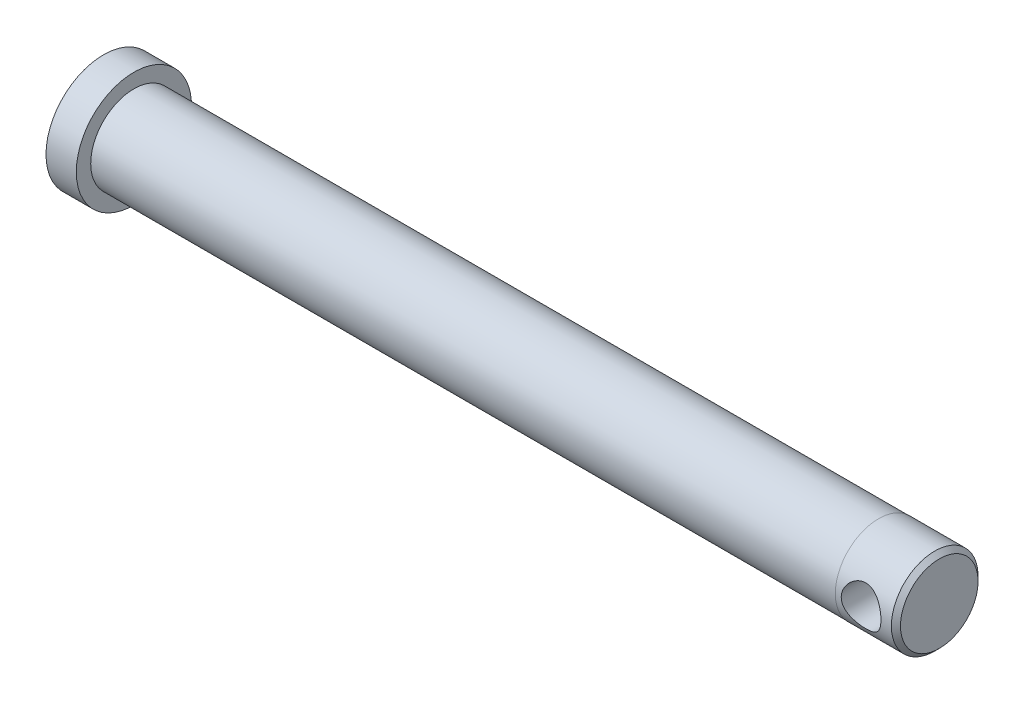
ISO-10303-21;
HEADER;
FILE_DESCRIPTION(('STEP AP214'),'2;1');
FILE_NAME('part.step','',(''),(''),'','','');
FILE_SCHEMA(('AUTOMOTIVE_DESIGN { 1 0 10303 214 1 1 1 1 }'));
ENDSEC;
DATA;
#1=APPLICATION_CONTEXT('core data for automotive mechanical design processes');
#2=APPLICATION_PROTOCOL_DEFINITION('international standard','automotive_design',2000,#1);
#3=PRODUCT_CONTEXT('',#1,'mechanical');
#4=PRODUCT('Part','Part','',(#3));
#5=PRODUCT_RELATED_PRODUCT_CATEGORY('part','',(#4));
#6=PRODUCT_DEFINITION_FORMATION('','',#4);
#7=PRODUCT_DEFINITION_CONTEXT('part definition',#1,'design');
#8=PRODUCT_DEFINITION('design','',#6,#7);
#9=PRODUCT_DEFINITION_SHAPE('','',#8);
#10=(LENGTH_UNIT() NAMED_UNIT(*) SI_UNIT(.MILLI.,.METRE.));
#11=(NAMED_UNIT(*) PLANE_ANGLE_UNIT() SI_UNIT($,.RADIAN.));
#12=(NAMED_UNIT(*) SI_UNIT($,.STERADIAN.) SOLID_ANGLE_UNIT());
#13=UNCERTAINTY_MEASURE_WITH_UNIT(LENGTH_MEASURE(1.E-05),#10,'distance_accuracy_value','');
#14=(GEOMETRIC_REPRESENTATION_CONTEXT(3) GLOBAL_UNCERTAINTY_ASSIGNED_CONTEXT((#13)) GLOBAL_UNIT_ASSIGNED_CONTEXT((#10,
#11,#12)) REPRESENTATION_CONTEXT('',''));
#15=CARTESIAN_POINT('',(0.,0.,0.));
#16=DIRECTION('',(0.,0.,1.));
#17=DIRECTION('',(1.,0.,0.));
#18=AXIS2_PLACEMENT_3D('',#15,#16,#17);
#19=CARTESIAN_POINT('',(275.7,0.,0.));
#20=DIRECTION('',(1.,0.,0.));
#21=DIRECTION('',(0.,0.,-1.));
#22=AXIS2_PLACEMENT_3D('',#19,#20,#21);
#23=PLANE('',#22);
#24=CARTESIAN_POINT('',(275.7,0.,0.));
#25=DIRECTION('',(-1.,0.,0.));
#26=DIRECTION('',(0.,0.,1.));
#27=AXIS2_PLACEMENT_3D('',#24,#25,#26);
#28=CIRCLE('',#27,12.8);
#29=CARTESIAN_POINT('',(275.7,0.,12.8));
#30=VERTEX_POINT('',#29);
#31=EDGE_CURVE('E18',#30,#30,#28,.T.);
#32=ORIENTED_EDGE('',*,*,#31,.F.);
#33=EDGE_LOOP('',(#32));
#34=FACE_BOUND('',#33,.T.);
#35=ADVANCED_FACE('F15',(#34),#23,.T.);
#36=CARTESIAN_POINT('',(274.2,0.,0.));
#37=DIRECTION('',(-1.,0.,0.));
#38=DIRECTION('',(0.,0.,1.));
#39=AXIS2_PLACEMENT_3D('',#36,#37,#38);
#40=CONICAL_SURFACE('',#39,14.3,0.785398163397445);
#41=ORIENTED_EDGE('',*,*,#31,.T.);
#42=EDGE_LOOP('',(#41));
#43=FACE_BOUND('',#42,.T.);
#44=CARTESIAN_POINT('',(274.2,0.,0.));
#45=DIRECTION('',(-1.,0.,0.));
#46=DIRECTION('',(0.,0.,1.));
#47=AXIS2_PLACEMENT_3D('',#44,#45,#46);
#48=CIRCLE('',#47,14.3);
#49=CARTESIAN_POINT('',(274.2,0.,14.3));
#50=VERTEX_POINT('',#49);
#51=EDGE_CURVE('E30',#50,#50,#48,.T.);
#52=ORIENTED_EDGE('',*,*,#51,.F.);
#53=EDGE_LOOP('',(#52));
#54=FACE_BOUND('',#53,.T.);
#55=ADVANCED_FACE('F67',(#43,#54),#40,.T.);
#56=CARTESIAN_POINT('',(264.2,0.,-14.3));
#57=DIRECTION('',(0.,0.,1.));
#58=DIRECTION('',(1.,0.,0.));
#59=AXIS2_PLACEMENT_3D('',#56,#57,#58);
#60=CYLINDRICAL_SURFACE('',#59,6.54999999999989);
#61=CARTESIAN_POINT('',(270.75,0.,14.3));
#62=CARTESIAN_POINT('',(270.750002344818,-0.174096956135707,14.3000019649308));
#63=CARTESIAN_POINT('',(270.743053933552,-0.348166047118767,14.2968146519149));
#64=CARTESIAN_POINT('',(270.715343602572,-0.695027982985587,14.2841535998475));
#65=CARTESIAN_POINT('',(270.694578134549,-0.867820488505898,14.2746782459881));
#66=CARTESIAN_POINT('',(270.639441254057,-1.21091530380531,14.2496772699428));
#67=CARTESIAN_POINT('',(270.605058575238,-1.38121543019745,14.2341466380212));
#68=CARTESIAN_POINT('',(270.523045212817,-1.71803834543361,14.1974313350743));
#69=CARTESIAN_POINT('',(270.475409288022,-1.8845596116353,14.176244427325));
#70=CARTESIAN_POINT('',(270.367573558354,-2.21204608993021,14.1288403114826));
#71=CARTESIAN_POINT('',(270.307420606164,-2.37302948398259,14.1026418907724));
#72=CARTESIAN_POINT('',(270.174970418304,-2.6891663972304,14.0457891999547));
#73=CARTESIAN_POINT('',(270.102668635728,-2.84431770696514,14.0151332621261));
#74=CARTESIAN_POINT('',(269.946546750346,-3.14782555717178,13.9500990650549));
#75=CARTESIAN_POINT('',(269.862730920268,-3.29618459107468,13.9157221876082));
#76=CARTESIAN_POINT('',(269.684161356506,-3.58544258509121,13.8440185791812));
#77=CARTESIAN_POINT('',(269.58940363437,-3.72633879744427,13.8066907741256));
#78=CARTESIAN_POINT('',(269.279079601369,-4.15121062465245,13.6874654841738));
#79=CARTESIAN_POINT('',(269.045648854499,-4.42138890372933,13.6018656558418));
#80=CARTESIAN_POINT('',(268.538191954486,-4.92029553144522,13.4294667600679));
#81=CARTESIAN_POINT('',(268.26414252845,-5.14899994905961,13.3426670311543));
#82=CARTESIAN_POINT('',(267.817886598909,-5.4634557601234,13.2156928964109));
#83=CARTESIAN_POINT('',(267.658079439567,-5.56599973630672,13.1727176666629));
#84=CARTESIAN_POINT('',(267.32950441936,-5.75715083807288,13.0903031245595));
#85=CARTESIAN_POINT('',(267.160740357195,-5.8457638097279,13.0508623320001));
#86=CARTESIAN_POINT('',(266.815247098023,-6.00828039042939,12.9768466740396));
#87=CARTESIAN_POINT('',(266.638517949202,-6.08218408844851,12.9422717792062));
#88=CARTESIAN_POINT('',(266.278371476682,-6.21447033210074,12.879275232294));
#89=CARTESIAN_POINT('',(266.094957897256,-6.27286141963944,12.8508501954481));
#90=CARTESIAN_POINT('',(265.732857624489,-6.37072151597935,12.8026060914288));
#91=CARTESIAN_POINT('',(265.554452633411,-6.41104381791461,12.7824044129567));
#92=CARTESIAN_POINT('',(265.194314564868,-6.47667485774603,12.7492760517046));
#93=CARTESIAN_POINT('',(265.012583171591,-6.50199098786733,12.7363457870976));
#94=CARTESIAN_POINT('',(264.647322295375,-6.53728192971901,12.7182679750249));
#95=CARTESIAN_POINT('',(264.463793560017,-6.54726286815385,12.7131173194694));
#96=CARTESIAN_POINT('',(264.096502563504,-6.551756375807,12.7108024188612));
#97=CARTESIAN_POINT('',(263.9127403198,-6.54627003995812,12.7136376084882));
#98=CARTESIAN_POINT('',(263.564330029934,-6.5211900503194,12.7265174893265));
#99=CARTESIAN_POINT('',(263.399550903593,-6.50301088026962,12.7358390196039));
#100=CARTESIAN_POINT('',(263.072240002458,-6.4543040303,12.7605919133228));
#101=CARTESIAN_POINT('',(262.909708966517,-6.4237723858926,12.7760252382916));
#102=CARTESIAN_POINT('',(262.588054791097,-6.35069530529717,12.8125068651424));
#103=CARTESIAN_POINT('',(262.428931020716,-6.30815211427052,12.8335541176457));
#104=CARTESIAN_POINT('',(262.114954086259,-6.21144763729314,12.8806369461084));
#105=CARTESIAN_POINT('',(261.960102609861,-6.15728183219387,12.9066744619789));
#106=CARTESIAN_POINT('',(261.652140605206,-6.03646239402446,12.9636290497865));
#107=CARTESIAN_POINT('',(261.499147127705,-5.96955580038562,12.994642511033));
#108=CARTESIAN_POINT('',(261.1993005429,-5.82460805513766,13.060255280915));
#109=CARTESIAN_POINT('',(261.052449677993,-5.7465628824125,13.0948558832976));
#110=CARTESIAN_POINT('',(260.622193594232,-5.49652421660849,13.2026960487818));
#111=CARTESIAN_POINT('',(260.348916569407,-5.30856103997222,13.2800066977908));
#112=CARTESIAN_POINT('',(259.807578048163,-4.8725878819715,13.446472620451));
#113=CARTESIAN_POINT('',(259.543017364691,-4.62036515400522,13.5360233632053));
#114=CARTESIAN_POINT('',(259.179879325313,-4.21120738250974,13.6666151386598));
#115=CARTESIAN_POINT('',(259.064371082427,-4.0695576734149,13.7095564085061));
#116=CARTESIAN_POINT('',(258.845316130497,-3.77667311956713,13.7931100508632));
#117=CARTESIAN_POINT('',(258.741764896136,-3.62544193485495,13.8337233014992));
#118=CARTESIAN_POINT('',(258.544033244138,-3.30886098910019,13.9129066466075));
#119=CARTESIAN_POINT('',(258.450295681105,-3.14320497191761,13.9513589944674));
#120=CARTESIAN_POINT('',(258.277281426428,-2.80360457872014,14.0235486225666));
#121=CARTESIAN_POINT('',(258.197998416619,-2.62966386612784,14.0572879613733));
#122=CARTESIAN_POINT('',(258.054763227819,-2.27488508634193,14.1190389757675));
#123=CARTESIAN_POINT('',(257.990789036298,-2.09405736128123,14.1470588667093));
#124=CARTESIAN_POINT('',(257.878787760395,-1.72674024505318,14.1965736748781));
#125=CARTESIAN_POINT('',(257.830754228111,-1.54025317645392,14.2180712300485));
#126=CARTESIAN_POINT('',(257.744294553771,-1.13027886033594,14.25699380931));
#127=CARTESIAN_POINT('',(257.708989555652,-0.905994576132998,14.2730614620847));
#128=CARTESIAN_POINT('',(257.661844322921,-0.454457621404112,14.2945630422837));
#129=CARTESIAN_POINT('',(257.650003060103,-0.22720508138962,14.2999974356687));
#130=CARTESIAN_POINT('',(257.649997655182,0.174096956135697,14.3000019649308));
#131=CARTESIAN_POINT('',(257.656946066448,0.348166047118756,14.2968146519149));
#132=CARTESIAN_POINT('',(257.684656397428,0.695027982985577,14.2841535998475));
#133=CARTESIAN_POINT('',(257.705421865451,0.867820488505888,14.2746782459881));
#134=CARTESIAN_POINT('',(257.760558745943,1.2109153038053,14.2496772699428));
#135=CARTESIAN_POINT('',(257.794941424762,1.38121543019744,14.2341466380212));
#136=CARTESIAN_POINT('',(257.876954787183,1.7180383454336,14.1974313350743));
#137=CARTESIAN_POINT('',(257.924590711978,1.88455961163529,14.176244427325));
#138=CARTESIAN_POINT('',(258.032426441646,2.2120460899302,14.1288403114826));
#139=CARTESIAN_POINT('',(258.092579393836,2.37302948398258,14.1026418907724));
#140=CARTESIAN_POINT('',(258.225029581696,2.68916639723039,14.0457891999547));
#141=CARTESIAN_POINT('',(258.297331364272,2.84431770696514,14.0151332621261));
#142=CARTESIAN_POINT('',(258.453453249654,3.14782555717179,13.9500990650549));
#143=CARTESIAN_POINT('',(258.537269079732,3.29618459107469,13.9157221876082));
#144=CARTESIAN_POINT('',(258.715838643494,3.58544258509122,13.8440185791812));
#145=CARTESIAN_POINT('',(258.81059636563,3.72633879744428,13.8066907741256));
#146=CARTESIAN_POINT('',(259.120920398631,4.15121062465246,13.6874654841738));
#147=CARTESIAN_POINT('',(259.354351145501,4.42138890372936,13.6018656558418));
#148=CARTESIAN_POINT('',(259.861808045514,4.92029553144524,13.4294667600679));
#149=CARTESIAN_POINT('',(260.13585747155,5.1489999490596,13.3426670311543));
#150=CARTESIAN_POINT('',(260.582113401091,5.46345576012337,13.2156928964109));
#151=CARTESIAN_POINT('',(260.741920560433,5.56599973630669,13.1727176666629));
#152=CARTESIAN_POINT('',(261.07049558064,5.75715083807286,13.0903031245595));
#153=CARTESIAN_POINT('',(261.239259642805,5.84576380972787,13.0508623320001));
#154=CARTESIAN_POINT('',(261.584752901977,6.00828039042937,12.9768466740396));
#155=CARTESIAN_POINT('',(261.761482050798,6.0821840884485,12.9422717792062));
#156=CARTESIAN_POINT('',(262.121628523318,6.21447033210073,12.879275232294));
#157=CARTESIAN_POINT('',(262.305042102744,6.27286141963943,12.8508501954481));
#158=CARTESIAN_POINT('',(262.667142375511,6.37072151597933,12.8026060914288));
#159=CARTESIAN_POINT('',(262.845547366589,6.41104381791459,12.7824044129567));
#160=CARTESIAN_POINT('',(263.205685435132,6.47667485774601,12.7492760517046));
#161=CARTESIAN_POINT('',(263.387416828409,6.50199098786731,12.7363457870977));
#162=CARTESIAN_POINT('',(263.752677704625,6.53728192971898,12.7182679750249));
#163=CARTESIAN_POINT('',(263.936206439983,6.54726286815382,12.7131173194694));
#164=CARTESIAN_POINT('',(264.303497436496,6.55175637580698,12.7108024188612));
#165=CARTESIAN_POINT('',(264.4872596802,6.54627003995809,12.7136376084882));
#166=CARTESIAN_POINT('',(264.835669970066,6.52119005031936,12.7265174893265));
#167=CARTESIAN_POINT('',(265.000449096407,6.50301088026958,12.735839019604));
#168=CARTESIAN_POINT('',(265.327759997542,6.45430403029996,12.7605919133228));
#169=CARTESIAN_POINT('',(265.490291033483,6.42377238589256,12.7760252382916));
#170=CARTESIAN_POINT('',(265.811945208903,6.35069530529714,12.8125068651424));
#171=CARTESIAN_POINT('',(265.971068979284,6.30815211427049,12.8335541176457));
#172=CARTESIAN_POINT('',(266.285045913741,6.21144763729311,12.8806369461084));
#173=CARTESIAN_POINT('',(266.439897390139,6.15728183219384,12.9066744619789));
#174=CARTESIAN_POINT('',(266.747859394794,6.03646239402443,12.9636290497865));
#175=CARTESIAN_POINT('',(266.900852872295,5.96955580038559,12.994642511033));
#176=CARTESIAN_POINT('',(267.2006994571,5.82460805513763,13.060255280915));
#177=CARTESIAN_POINT('',(267.347550322007,5.74656288241247,13.0948558832976));
#178=CARTESIAN_POINT('',(267.777806405767,5.49652421660846,13.2026960487818));
#179=CARTESIAN_POINT('',(268.051083430593,5.30856103997219,13.2800066977908));
#180=CARTESIAN_POINT('',(268.592421951837,4.87258788197148,13.446472620451));
#181=CARTESIAN_POINT('',(268.856982635309,4.62036515400519,13.5360233632053));
#182=CARTESIAN_POINT('',(269.220120674687,4.21120738250972,13.6666151386598));
#183=CARTESIAN_POINT('',(269.335628917573,4.06955767341487,13.7095564085061));
#184=CARTESIAN_POINT('',(269.554683869503,3.7766731195671,13.7931100508632));
#185=CARTESIAN_POINT('',(269.658235103864,3.62544193485491,13.8337233014992));
#186=CARTESIAN_POINT('',(269.855966755862,3.30886098910016,13.9129066466075));
#187=CARTESIAN_POINT('',(269.949704318895,3.14320497191758,13.9513589944674));
#188=CARTESIAN_POINT('',(270.122718573571,2.8036045787201,14.0235486225667));
#189=CARTESIAN_POINT('',(270.202001583381,2.6296638661278,14.0572879613733));
#190=CARTESIAN_POINT('',(270.345236772181,2.2748850863419,14.1190389757675));
#191=CARTESIAN_POINT('',(270.409210963702,2.0940573612812,14.1470588667093));
#192=CARTESIAN_POINT('',(270.521212239605,1.72674024505315,14.1965736748781));
#193=CARTESIAN_POINT('',(270.569245771889,1.54025317645388,14.2180712300485));
#194=CARTESIAN_POINT('',(270.655705446229,1.1302788603359,14.25699380931));
#195=CARTESIAN_POINT('',(270.691010444348,0.905994576132961,14.2730614620847));
#196=CARTESIAN_POINT('',(270.738155677079,0.454457621404088,14.2945630422837));
#197=CARTESIAN_POINT('',(270.749996939897,0.227205081389603,14.2999974356687));
#198=CARTESIAN_POINT('',(270.75,0.,14.3));
#199=B_SPLINE_CURVE_WITH_KNOTS('',3,(#61,#62,#63,#64,#65,#66,#67,#68,#69,#70,#71,#72,#73,#74,
#75,#76,#77,#78,#79,#80,#81,#82,#83,#84,#85,#86,#87,#88,#89,#90,#91,#92,#93,#94,#95,#96,#97,#98,
#99,#100,#101,#102,#103,#104,#105,#106,#107,#108,#109,#110,#111,#112,#113,#114,#115,#116,#117,
#118,#119,#120,#121,#122,#123,#124,#125,#126,#127,#128,#129,#130,#131,#132,#133,#134,#135,#136,
#137,#138,#139,#140,#141,#142,#143,#144,#145,#146,#147,#148,#149,#150,#151,#152,#153,#154,#155,
#156,#157,#158,#159,#160,#161,#162,#163,#164,#165,#166,#167,#168,#169,#170,#171,#172,#173,#174,
#175,#176,#177,#178,#179,#180,#181,#182,#183,#184,#185,#186,#187,#188,#189,#190,#191,#192,#193,
#194,#195,#196,#197,#198),.UNSPECIFIED.,.T.,.F.,(4,2,2,2,2,2,2,2,2,2,2,2,2,2,2,2,2,2,2,2,2,2,2,
2,2,2,2,2,2,2,2,2,2,2,2,2,2,2,2,2,2,2,2,2,2,2,2,2,2,2,2,2,2,2,2,2,2,2,2,2,2,2,2,2,2,2,2,2,4),
(0.,0.522076012896042,1.04428615005701,1.56692924918336,2.08977932979005,2.61070643549664,
3.13182894308322,3.65275858801919,4.1738787211345,5.27040987232678,6.36757173864763,
6.95098935803069,7.53416149199517,8.11733009839305,8.70017691854299,9.2514682166265,
9.80248771564213,10.3532870144579,10.9040473230119,11.401585276136,11.8992830393267,
12.3968878358985,12.8946864647781,13.4036561450894,13.9128100344925,14.9305719233806,
16.0542242342373,16.6169573423203,17.1794767723519,17.7612772524697,18.3428228114447,
18.923527073419,19.5039961568614,20.1853608628227,20.8666957099935,21.3887717228895,
21.9109818600505,22.4336249591768,22.9564750397835,23.4774021454901,23.9985246530767,
24.5194542980127,25.040574431128,26.1371055823203,27.2342674486411,27.8176850680241,
28.4008572019886,28.9840258083866,29.5668726285365,30.11816392662,30.6691834256356,
31.2199827244514,31.7707430330054,32.2682809861296,32.7659787493202,33.263583545892,
33.7613821747715,34.2703518550828,34.7795057444859,35.797267633374,36.9209199442308,
37.4836530523137,38.0461724823454,38.6279729624631,39.2095185214382,39.7902227834124,
40.3706918668549,41.0520565728161,41.7333914199869),.UNSPECIFIED.);
#200=CARTESIAN_POINT('',(270.75,0.,14.3));
#201=VERTEX_POINT('',#200);
#202=EDGE_CURVE('E46',#201,#201,#199,.T.);
#203=ORIENTED_EDGE('',*,*,#202,.F.);
#204=EDGE_LOOP('',(#203));
#205=FACE_BOUND('',#204,.T.);
#206=CARTESIAN_POINT('',(257.65,0.,-14.3));
#207=CARTESIAN_POINT('',(257.649997655182,-0.174096956135697,-14.3000019649308));
#208=CARTESIAN_POINT('',(257.656946066448,-0.348166047118756,-14.2968146519149));
#209=CARTESIAN_POINT('',(257.684656397428,-0.695027982985578,-14.2841535998475));
#210=CARTESIAN_POINT('',(257.705421865451,-0.86782048850589,-14.2746782459881));
#211=CARTESIAN_POINT('',(257.760558745943,-1.2109153038053,-14.2496772699428));
#212=CARTESIAN_POINT('',(257.794941424762,-1.38121543019744,-14.2341466380212));
#213=CARTESIAN_POINT('',(257.876954787183,-1.7180383454336,-14.1974313350743));
#214=CARTESIAN_POINT('',(257.924590711978,-1.88455961163529,-14.176244427325));
#215=CARTESIAN_POINT('',(258.032426441646,-2.21204608993019,-14.1288403114826));
#216=CARTESIAN_POINT('',(258.092579393836,-2.37302948398255,-14.1026418907724));
#217=CARTESIAN_POINT('',(258.225029581696,-2.68916639723035,-14.0457891999547));
#218=CARTESIAN_POINT('',(258.297331364272,-2.8443177069651,-14.0151332621261));
#219=CARTESIAN_POINT('',(258.453453249654,-3.14782555717175,-13.9500990650549));
#220=CARTESIAN_POINT('',(258.537269079732,-3.29618459107466,-13.9157221876082));
#221=CARTESIAN_POINT('',(258.715838643494,-3.58544258509119,-13.8440185791812));
#222=CARTESIAN_POINT('',(258.81059636563,-3.72633879744425,-13.8066907741256));
#223=CARTESIAN_POINT('',(259.120920398631,-4.15121062465243,-13.6874654841738));
#224=CARTESIAN_POINT('',(259.354351145501,-4.42138890372932,-13.6018656558418));
#225=CARTESIAN_POINT('',(259.861808045514,-4.92029553144521,-13.4294667600679));
#226=CARTESIAN_POINT('',(260.13585747155,-5.14899994905958,-13.3426670311543));
#227=CARTESIAN_POINT('',(260.582113401091,-5.46345576012338,-13.2156928964109));
#228=CARTESIAN_POINT('',(260.741920560433,-5.5659997363067,-13.1727176666629));
#229=CARTESIAN_POINT('',(261.07049558064,-5.75715083807288,-13.0903031245595));
#230=CARTESIAN_POINT('',(261.239259642805,-5.84576380972789,-13.0508623320001));
#231=CARTESIAN_POINT('',(261.584752901977,-6.00828039042938,-12.9768466740396));
#232=CARTESIAN_POINT('',(261.761482050798,-6.0821840884485,-12.9422717792062));
#233=CARTESIAN_POINT('',(262.121628523318,-6.21447033210073,-12.879275232294));
#234=CARTESIAN_POINT('',(262.305042102744,-6.27286141963943,-12.8508501954481));
#235=CARTESIAN_POINT('',(262.667142375511,-6.37072151597935,-12.8026060914288));
#236=CARTESIAN_POINT('',(262.845547366589,-6.41104381791461,-12.7824044129567));
#237=CARTESIAN_POINT('',(263.205685435131,-6.47667485774603,-12.7492760517046));
#238=CARTESIAN_POINT('',(263.387416828409,-6.50199098786733,-12.7363457870976));
#239=CARTESIAN_POINT('',(263.752677704625,-6.53728192971901,-12.7182679750249));
#240=CARTESIAN_POINT('',(263.936206439983,-6.54726286815385,-12.7131173194694));
#241=CARTESIAN_POINT('',(264.303497436496,-6.551756375807,-12.7108024188612));
#242=CARTESIAN_POINT('',(264.4872596802,-6.54627003995812,-12.7136376084882));
#243=CARTESIAN_POINT('',(264.835669970066,-6.5211900503194,-12.7265174893265));
#244=CARTESIAN_POINT('',(265.000449096407,-6.50301088026962,-12.7358390196039));
#245=CARTESIAN_POINT('',(265.327759997542,-6.4543040303,-12.7605919133228));
#246=CARTESIAN_POINT('',(265.490291033483,-6.4237723858926,-12.7760252382916));
#247=CARTESIAN_POINT('',(265.811945208903,-6.35069530529717,-12.8125068651424));
#248=CARTESIAN_POINT('',(265.971068979284,-6.30815211427052,-12.8335541176457));
#249=CARTESIAN_POINT('',(266.285045913741,-6.21144763729314,-12.8806369461084));
#250=CARTESIAN_POINT('',(266.439897390139,-6.15728183219387,-12.9066744619789));
#251=CARTESIAN_POINT('',(266.747859394794,-6.03646239402447,-12.9636290497865));
#252=CARTESIAN_POINT('',(266.900852872295,-5.96955580038563,-12.994642511033));
#253=CARTESIAN_POINT('',(267.2006994571,-5.82460805513768,-13.060255280915));
#254=CARTESIAN_POINT('',(267.347550322007,-5.74656288241251,-13.0948558832976));
#255=CARTESIAN_POINT('',(267.777806405767,-5.49652421660848,-13.2026960487818));
#256=CARTESIAN_POINT('',(268.051083430593,-5.30856103997221,-13.2800066977908));
#257=CARTESIAN_POINT('',(268.592421951837,-4.87258788197151,-13.446472620451));
#258=CARTESIAN_POINT('',(268.856982635309,-4.62036515400522,-13.5360233632053));
#259=CARTESIAN_POINT('',(269.220120674687,-4.21120738250974,-13.6666151386598));
#260=CARTESIAN_POINT('',(269.335628917573,-4.0695576734149,-13.7095564085061));
#261=CARTESIAN_POINT('',(269.554683869503,-3.77667311956713,-13.7931100508632));
#262=CARTESIAN_POINT('',(269.658235103864,-3.62544193485495,-13.8337233014992));
#263=CARTESIAN_POINT('',(269.855966755862,-3.3088609891002,-13.9129066466075));
#264=CARTESIAN_POINT('',(269.949704318895,-3.14320497191761,-13.9513589944674));
#265=CARTESIAN_POINT('',(270.122718573571,-2.80360457872015,-14.0235486225666));
#266=CARTESIAN_POINT('',(270.202001583381,-2.62966386612785,-14.0572879613733));
#267=CARTESIAN_POINT('',(270.345236772181,-2.27488508634195,-14.1190389757675));
#268=CARTESIAN_POINT('',(270.409210963702,-2.09405736128126,-14.1470588667093));
#269=CARTESIAN_POINT('',(270.521212239605,-1.72674024505322,-14.1965736748781));
#270=CARTESIAN_POINT('',(270.569245771889,-1.54025317645396,-14.2180712300485));
#271=CARTESIAN_POINT('',(270.655705446229,-1.13027886033597,-14.25699380931));
#272=CARTESIAN_POINT('',(270.691010444348,-0.905994576133017,-14.2730614620847));
#273=CARTESIAN_POINT('',(270.738155677079,-0.454457621404125,-14.2945630422837));
#274=CARTESIAN_POINT('',(270.749996939897,-0.227205081389634,-14.2999974356687));
#275=CARTESIAN_POINT('',(270.750002344818,0.174096956135683,-14.3000019649308));
#276=CARTESIAN_POINT('',(270.743053933552,0.348166047118744,-14.2968146519149));
#277=CARTESIAN_POINT('',(270.715343602572,0.695027982985566,-14.2841535998475));
#278=CARTESIAN_POINT('',(270.694578134549,0.867820488505877,-14.2746782459881));
#279=CARTESIAN_POINT('',(270.639441254057,1.21091530380529,-14.2496772699428));
#280=CARTESIAN_POINT('',(270.605058575238,1.38121543019743,-14.2341466380212));
#281=CARTESIAN_POINT('',(270.523045212817,1.71803834543359,-14.1974313350743));
#282=CARTESIAN_POINT('',(270.475409288022,1.88455961163528,-14.176244427325));
#283=CARTESIAN_POINT('',(270.367573558354,2.21204608993019,-14.1288403114826));
#284=CARTESIAN_POINT('',(270.307420606164,2.37302948398258,-14.1026418907724));
#285=CARTESIAN_POINT('',(270.174970418304,2.68916639723039,-14.0457891999547));
#286=CARTESIAN_POINT('',(270.102668635728,2.84431770696515,-14.0151332621261));
#287=CARTESIAN_POINT('',(269.946546750346,3.1478255571718,-13.9500990650549));
#288=CARTESIAN_POINT('',(269.862730920268,3.29618459107473,-13.9157221876082));
#289=CARTESIAN_POINT('',(269.684161356506,3.58544258509125,-13.8440185791812));
#290=CARTESIAN_POINT('',(269.58940363437,3.72633879744429,-13.8066907741256));
#291=CARTESIAN_POINT('',(269.279079601369,4.15121062465246,-13.6874654841738));
#292=CARTESIAN_POINT('',(269.045648854499,4.42138890372936,-13.6018656558418));
#293=CARTESIAN_POINT('',(268.538191954486,4.92029553144524,-13.4294667600679));
#294=CARTESIAN_POINT('',(268.26414252845,5.1489999490596,-13.3426670311543));
#295=CARTESIAN_POINT('',(267.817886598909,5.46345576012338,-13.2156928964109));
#296=CARTESIAN_POINT('',(267.658079439567,5.56599973630671,-13.1727176666629));
#297=CARTESIAN_POINT('',(267.32950441936,5.75715083807289,-13.0903031245595));
#298=CARTESIAN_POINT('',(267.160740357195,5.84576380972791,-13.0508623320001));
#299=CARTESIAN_POINT('',(266.815247098022,6.00828039042939,-12.9768466740396));
#300=CARTESIAN_POINT('',(266.638517949202,6.08218408844849,-12.9422717792062));
#301=CARTESIAN_POINT('',(266.278371476682,6.21447033210071,-12.879275232294));
#302=CARTESIAN_POINT('',(266.094957897256,6.27286141963941,-12.8508501954481));
#303=CARTESIAN_POINT('',(265.732857624489,6.37072151597932,-12.8026060914288));
#304=CARTESIAN_POINT('',(265.554452633411,6.41104381791458,-12.7824044129567));
#305=CARTESIAN_POINT('',(265.194314564868,6.476674857746,-12.7492760517046));
#306=CARTESIAN_POINT('',(265.012583171591,6.50199098786731,-12.7363457870977));
#307=CARTESIAN_POINT('',(264.647322295375,6.53728192971898,-12.7182679750249));
#308=CARTESIAN_POINT('',(264.463793560017,6.54726286815382,-12.7131173194694));
#309=CARTESIAN_POINT('',(264.096502563504,6.55175637580698,-12.7108024188612));
#310=CARTESIAN_POINT('',(263.9127403198,6.54627003995809,-12.7136376084882));
#311=CARTESIAN_POINT('',(263.564330029935,6.52119005031937,-12.7265174893265));
#312=CARTESIAN_POINT('',(263.399550903593,6.5030108802696,-12.7358390196039));
#313=CARTESIAN_POINT('',(263.072240002458,6.45430403029998,-12.7605919133228));
#314=CARTESIAN_POINT('',(262.909708966517,6.42377238589258,-12.7760252382916));
#315=CARTESIAN_POINT('',(262.588054791097,6.35069530529714,-12.8125068651424));
#316=CARTESIAN_POINT('',(262.428931020716,6.3081521142705,-12.8335541176457));
#317=CARTESIAN_POINT('',(262.114954086259,6.21144763729312,-12.8806369461084));
#318=CARTESIAN_POINT('',(261.960102609861,6.15728183219384,-12.9066744619789));
#319=CARTESIAN_POINT('',(261.652140605206,6.03646239402444,-12.9636290497865));
#320=CARTESIAN_POINT('',(261.499147127705,5.96955580038561,-12.994642511033));
#321=CARTESIAN_POINT('',(261.1993005429,5.82460805513765,-13.060255280915));
#322=CARTESIAN_POINT('',(261.052449677993,5.74656288241248,-13.0948558832976));
#323=CARTESIAN_POINT('',(260.622193594232,5.49652421660845,-13.2026960487818));
#324=CARTESIAN_POINT('',(260.348916569407,5.30856103997218,-13.2800066977908));
#325=CARTESIAN_POINT('',(259.807578048163,4.87258788197148,-13.446472620451));
#326=CARTESIAN_POINT('',(259.543017364691,4.62036515400519,-13.5360233632053));
#327=CARTESIAN_POINT('',(259.179879325313,4.21120738250972,-13.6666151386598));
#328=CARTESIAN_POINT('',(259.064371082427,4.06955767341487,-13.7095564085061));
#329=CARTESIAN_POINT('',(258.845316130497,3.7766731195671,-13.7931100508632));
#330=CARTESIAN_POINT('',(258.741764896136,3.62544193485492,-13.8337233014992));
#331=CARTESIAN_POINT('',(258.544033244138,3.30886098910016,-13.9129066466075));
#332=CARTESIAN_POINT('',(258.450295681105,3.14320497191758,-13.9513589944674));
#333=CARTESIAN_POINT('',(258.277281426428,2.80360457872011,-14.0235486225667));
#334=CARTESIAN_POINT('',(258.197998416619,2.62966386612781,-14.0572879613733));
#335=CARTESIAN_POINT('',(258.054763227819,2.27488508634191,-14.1190389757675));
#336=CARTESIAN_POINT('',(257.990789036298,2.09405736128121,-14.1470588667093));
#337=CARTESIAN_POINT('',(257.878787760395,1.72674024505316,-14.1965736748781));
#338=CARTESIAN_POINT('',(257.830754228111,1.54025317645389,-14.2180712300485));
#339=CARTESIAN_POINT('',(257.744294553771,1.13027886033591,-14.25699380931));
#340=CARTESIAN_POINT('',(257.708989555652,0.905994576132972,-14.2730614620847));
#341=CARTESIAN_POINT('',(257.661844322921,0.454457621404098,-14.2945630422837));
#342=CARTESIAN_POINT('',(257.650003060103,0.227205081389613,-14.2999974356687));
#343=CARTESIAN_POINT('',(257.65,0.,-14.3));
#344=B_SPLINE_CURVE_WITH_KNOTS('',3,(#206,#207,#208,#209,#210,#211,#212,#213,#214,#215,#216,
#217,#218,#219,#220,#221,#222,#223,#224,#225,#226,#227,#228,#229,#230,#231,#232,#233,#234,#235,
#236,#237,#238,#239,#240,#241,#242,#243,#244,#245,#246,#247,#248,#249,#250,#251,#252,#253,#254,
#255,#256,#257,#258,#259,#260,#261,#262,#263,#264,#265,#266,#267,#268,#269,#270,#271,#272,#273,
#274,#275,#276,#277,#278,#279,#280,#281,#282,#283,#284,#285,#286,#287,#288,#289,#290,#291,#292,
#293,#294,#295,#296,#297,#298,#299,#300,#301,#302,#303,#304,#305,#306,#307,#308,#309,#310,#311,
#312,#313,#314,#315,#316,#317,#318,#319,#320,#321,#322,#323,#324,#325,#326,#327,#328,#329,#330,
#331,#332,#333,#334,#335,#336,#337,#338,#339,#340,#341,#342,#343),.UNSPECIFIED.,.T.,.F.,(4,2,2,
2,2,2,2,2,2,2,2,2,2,2,2,2,2,2,2,2,2,2,2,2,2,2,2,2,2,2,2,2,2,2,2,2,2,2,2,2,2,2,2,2,2,2,2,2,2,2,2,
2,2,2,2,2,2,2,2,2,2,2,2,2,2,2,2,2,4),(0.,0.522076012896042,1.04428615005701,1.56692924918336,
2.08977932979004,2.6107064354966,3.1318289430832,3.65275858801918,4.1738787211345,
5.27040987232674,6.36757173864758,6.9509893580307,7.53416149199518,8.117330098393,
8.70017691854301,9.25146821662651,9.80248771564215,10.353287014458,10.9040473230119,
11.401585276136,11.8992830393268,12.3968878358986,12.8946864647781,13.4036561450894,
13.9128100344925,14.9305719233806,16.0542242342374,16.6169573423203,17.1794767723519,
17.7612772524697,18.3428228114447,18.9235270734189,19.5039961568614,20.1853608628227,
20.8666957099935,21.3887717228895,21.9109818600505,22.4336249591768,22.9564750397835,
23.4774021454901,23.9985246530767,24.5194542980127,25.040574431128,26.1371055823203,
27.2342674486411,27.8176850680242,28.4008572019887,28.9840258083864,29.5668726285364,
30.11816392662,30.6691834256356,31.2199827244514,31.7707430330054,32.2682809861294,
32.7659787493202,33.2635835458919,33.7613821747715,34.2703518550828,34.7795057444859,
35.797267633374,36.9209199442308,37.4836530523137,38.0461724823454,38.6279729624632,
39.2095185214382,39.7902227834124,40.3706918668549,41.0520565728162,41.7333914199869),.UNSPECIFIED.);
#345=CARTESIAN_POINT('',(257.65,0.,-14.3));
#346=VERTEX_POINT('',#345);
#347=EDGE_CURVE('E40',#346,#346,#344,.T.);
#348=ORIENTED_EDGE('',*,*,#347,.F.);
#349=EDGE_LOOP('',(#348));
#350=FACE_BOUND('',#349,.T.);
#351=ADVANCED_FACE('F49',(#205,#350),#60,.F.);
#352=CARTESIAN_POINT('',(0.,0.,0.));
#353=DIRECTION('',(1.,0.,0.));
#354=DIRECTION('',(0.,0.,-1.));
#355=AXIS2_PLACEMENT_3D('',#352,#353,#354);
#356=PLANE('',#355);
#357=CARTESIAN_POINT('',(0.,0.,0.));
#358=DIRECTION('',(-1.,0.,0.));
#359=DIRECTION('',(0.,0.,1.));
#360=AXIS2_PLACEMENT_3D('',#357,#358,#359);
#361=CIRCLE('',#360,19.);
#362=CARTESIAN_POINT('',(0.,0.,19.));
#363=VERTEX_POINT('',#362);
#364=EDGE_CURVE('E37',#363,#363,#361,.F.);
#365=ORIENTED_EDGE('',*,*,#364,.F.);
#366=EDGE_LOOP('',(#365));
#367=FACE_BOUND('',#366,.T.);
#368=ADVANCED_FACE('F57',(#367),#356,.F.);
#369=CARTESIAN_POINT('',(275.7,0.,0.));
#370=DIRECTION('',(-1.,0.,0.));
#371=DIRECTION('',(0.,0.,1.));
#372=AXIS2_PLACEMENT_3D('',#369,#370,#371);
#373=CYLINDRICAL_SURFACE('',#372,14.3);
#374=ORIENTED_EDGE('',*,*,#51,.T.);
#375=EDGE_LOOP('',(#374));
#376=FACE_BOUND('',#375,.T.);
#377=ORIENTED_EDGE('',*,*,#202,.T.);
#378=EDGE_LOOP('',(#377));
#379=FACE_BOUND('',#378,.T.);
#380=CARTESIAN_POINT('',(255.7,0.,0.));
#381=DIRECTION('',(-1.,0.,0.));
#382=DIRECTION('',(0.,0.,1.));
#383=AXIS2_PLACEMENT_3D('',#380,#381,#382);
#384=CIRCLE('',#383,14.3);
#385=CARTESIAN_POINT('',(255.7,0.,14.3));
#386=VERTEX_POINT('',#385);
#387=EDGE_CURVE('E34',#386,#386,#384,.F.);
#388=ORIENTED_EDGE('',*,*,#387,.T.);
#389=EDGE_LOOP('',(#388));
#390=FACE_BOUND('',#389,.T.);
#391=ORIENTED_EDGE('',*,*,#347,.T.);
#392=EDGE_LOOP('',(#391));
#393=FACE_BOUND('',#392,.T.);
#394=ADVANCED_FACE('F52',(#376,#379,#390,#393),#373,.T.);
#395=CARTESIAN_POINT('',(10.,0.,0.));
#396=DIRECTION('',(-1.,0.,0.));
#397=DIRECTION('',(0.,0.,1.));
#398=AXIS2_PLACEMENT_3D('',#395,#396,#397);
#399=CYLINDRICAL_SURFACE('',#398,19.);
#400=ORIENTED_EDGE('',*,*,#364,.T.);
#401=EDGE_LOOP('',(#400));
#402=FACE_BOUND('',#401,.T.);
#403=CARTESIAN_POINT('',(10.,0.,0.));
#404=DIRECTION('',(-1.,0.,0.));
#405=DIRECTION('',(0.,0.,1.));
#406=AXIS2_PLACEMENT_3D('',#403,#404,#405);
#407=CIRCLE('',#406,19.);
#408=CARTESIAN_POINT('',(10.,0.,19.));
#409=VERTEX_POINT('',#408);
#410=EDGE_CURVE('E27',#409,#409,#407,.T.);
#411=ORIENTED_EDGE('',*,*,#410,.T.);
#412=EDGE_LOOP('',(#411));
#413=FACE_BOUND('',#412,.T.);
#414=ADVANCED_FACE('F56',(#402,#413),#399,.T.);
#415=CARTESIAN_POINT('',(255.7,0.,0.));
#416=DIRECTION('',(1.,0.,0.));
#417=DIRECTION('',(0.,0.,-1.));
#418=AXIS2_PLACEMENT_3D('',#415,#416,#417);
#419=PLANE('',#418);
#420=CARTESIAN_POINT('',(255.7,0.,0.));
#421=DIRECTION('',(-1.,0.,0.));
#422=DIRECTION('',(0.,0.,1.));
#423=AXIS2_PLACEMENT_3D('',#420,#421,#422);
#424=CIRCLE('',#423,14.25);
#425=CARTESIAN_POINT('',(255.7,0.,14.25));
#426=VERTEX_POINT('',#425);
#427=EDGE_CURVE('E22',#426,#426,#424,.T.);
#428=ORIENTED_EDGE('',*,*,#427,.F.);
#429=EDGE_LOOP('',(#428));
#430=FACE_BOUND('',#429,.T.);
#431=ORIENTED_EDGE('',*,*,#387,.F.);
#432=EDGE_LOOP('',(#431));
#433=FACE_BOUND('',#432,.T.);
#434=ADVANCED_FACE('F77',(#430,#433),#419,.F.);
#435=CARTESIAN_POINT('',(10.,0.,0.));
#436=DIRECTION('',(-1.,0.,0.));
#437=DIRECTION('',(0.,0.,1.));
#438=AXIS2_PLACEMENT_3D('',#435,#436,#437);
#439=PLANE('',#438);
#440=CARTESIAN_POINT('',(10.,0.,0.));
#441=DIRECTION('',(-1.,0.,0.));
#442=DIRECTION('',(0.,0.,1.));
#443=AXIS2_PLACEMENT_3D('',#440,#441,#442);
#444=CIRCLE('',#443,14.25);
#445=CARTESIAN_POINT('',(10.,0.,14.25));
#446=VERTEX_POINT('',#445);
#447=EDGE_CURVE('E10',#446,#446,#444,.F.);
#448=ORIENTED_EDGE('',*,*,#447,.F.);
#449=EDGE_LOOP('',(#448));
#450=FACE_BOUND('',#449,.T.);
#451=ORIENTED_EDGE('',*,*,#410,.F.);
#452=EDGE_LOOP('',(#451));
#453=FACE_BOUND('',#452,.T.);
#454=ADVANCED_FACE('F72',(#450,#453),#439,.F.);
#455=CARTESIAN_POINT('',(304.505086527633,0.,0.));
#456=DIRECTION('',(-1.,0.,0.));
#457=DIRECTION('',(0.,0.,1.));
#458=AXIS2_PLACEMENT_3D('',#455,#456,#457);
#459=CYLINDRICAL_SURFACE('',#458,14.25);
#460=ORIENTED_EDGE('',*,*,#447,.T.);
#461=EDGE_LOOP('',(#460));
#462=FACE_BOUND('',#461,.T.);
#463=ORIENTED_EDGE('',*,*,#427,.T.);
#464=EDGE_LOOP('',(#463));
#465=FACE_BOUND('',#464,.T.);
#466=ADVANCED_FACE('F70',(#462,#465),#459,.T.);
#467=CLOSED_SHELL('',(#35,#55,#351,#368,#394,#414,#434,#454,#466));
#468=MANIFOLD_SOLID_BREP('B1',#467);
#469=ADVANCED_BREP_SHAPE_REPRESENTATION('',(#18,#468),#14);
#470=SHAPE_DEFINITION_REPRESENTATION(#9,#469);
ENDSEC;
END-ISO-10303-21;
